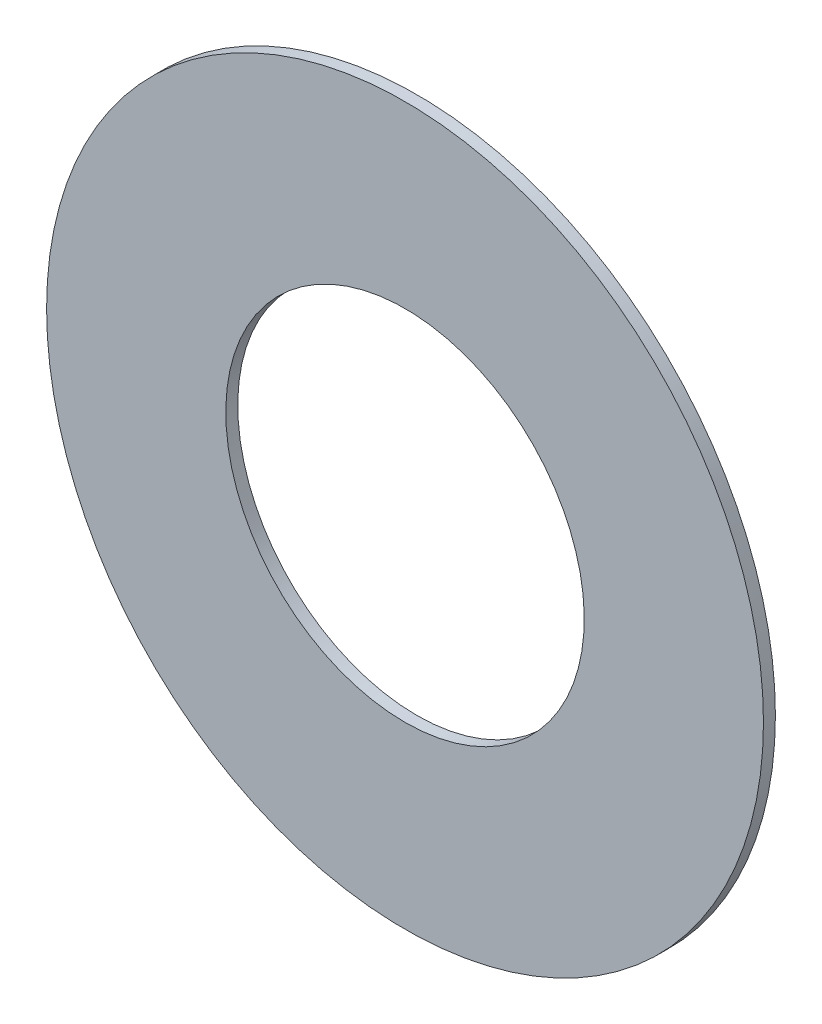
ISO-10303-21;
HEADER;
FILE_DESCRIPTION(('STEP AP214'),'2;1');
FILE_NAME('part.step','',(''),(''),'','','');
FILE_SCHEMA(('AUTOMOTIVE_DESIGN { 1 0 10303 214 1 1 1 1 }'));
ENDSEC;
DATA;
#1=APPLICATION_CONTEXT('core data for automotive mechanical design processes');
#2=APPLICATION_PROTOCOL_DEFINITION('international standard','automotive_design',2000,#1);
#3=PRODUCT_CONTEXT('',#1,'mechanical');
#4=PRODUCT('Part','Part','',(#3));
#5=PRODUCT_RELATED_PRODUCT_CATEGORY('part','',(#4));
#6=PRODUCT_DEFINITION_FORMATION('','',#4);
#7=PRODUCT_DEFINITION_CONTEXT('part definition',#1,'design');
#8=PRODUCT_DEFINITION('design','',#6,#7);
#9=PRODUCT_DEFINITION_SHAPE('','',#8);
#10=(LENGTH_UNIT() NAMED_UNIT(*) SI_UNIT(.MILLI.,.METRE.));
#11=(NAMED_UNIT(*) PLANE_ANGLE_UNIT() SI_UNIT($,.RADIAN.));
#12=(NAMED_UNIT(*) SI_UNIT($,.STERADIAN.) SOLID_ANGLE_UNIT());
#13=UNCERTAINTY_MEASURE_WITH_UNIT(LENGTH_MEASURE(1.E-05),#10,'distance_accuracy_value','');
#14=(GEOMETRIC_REPRESENTATION_CONTEXT(3) GLOBAL_UNCERTAINTY_ASSIGNED_CONTEXT((#13)) GLOBAL_UNIT_ASSIGNED_CONTEXT((#10,
#11,#12)) REPRESENTATION_CONTEXT('',''));
#15=CARTESIAN_POINT('',(0.,0.,0.));
#16=DIRECTION('',(0.,0.,1.));
#17=DIRECTION('',(1.,0.,0.));
#18=AXIS2_PLACEMENT_3D('',#15,#16,#17);
#19=CARTESIAN_POINT('',(139.452,-114.284,-0.045));
#20=DIRECTION('',(0.,0.,-1.));
#21=DIRECTION('',(0.,-1.,0.));
#22=AXIS2_PLACEMENT_3D('',#19,#20,#21);
#23=CYLINDRICAL_SURFACE('',#22,0.525);
#24=CARTESIAN_POINT('',(139.452,-114.284,-0.035));
#25=DIRECTION('',(0.,0.,-1.));
#26=DIRECTION('',(0.,-1.,0.));
#27=AXIS2_PLACEMENT_3D('',#24,#25,#26);
#28=CIRCLE('',#27,0.525);
#29=CARTESIAN_POINT('',(139.452,-114.809,-0.035));
#30=VERTEX_POINT('',#29);
#31=EDGE_CURVE('E25',#30,#30,#28,.T.);
#32=ORIENTED_EDGE('',*,*,#31,.T.);
#33=DIRECTION('',(0.,0.,1.));
#34=VECTOR('',#33,1.);
#35=CARTESIAN_POINT('',(139.452,-114.809,-0.045));
#36=LINE('',#35,#34);
#37=CARTESIAN_POINT('',(139.452,-114.809,0.));
#38=VERTEX_POINT('',#37);
#39=EDGE_CURVE('E11',#30,#38,#36,.T.);
#40=ORIENTED_EDGE('',*,*,#39,.T.);
#41=CARTESIAN_POINT('',(139.452,-114.284,0.));
#42=DIRECTION('',(0.,0.,-1.));
#43=DIRECTION('',(0.,-1.,0.));
#44=AXIS2_PLACEMENT_3D('',#41,#42,#43);
#45=CIRCLE('',#44,0.525);
#46=EDGE_CURVE('E67',#38,#38,#45,.T.);
#47=ORIENTED_EDGE('',*,*,#46,.F.);
#48=ORIENTED_EDGE('',*,*,#39,.F.);
#49=EDGE_LOOP('',(#32,#40,#47,#48));
#50=FACE_BOUND('',#49,.T.);
#51=ADVANCED_FACE('F17',(#50),#23,.F.);
#52=CARTESIAN_POINT('',(139.452,-114.284,-0.035));
#53=DIRECTION('',(0.,0.,1.));
#54=DIRECTION('',(1.,0.,0.));
#55=AXIS2_PLACEMENT_3D('',#52,#53,#54);
#56=PLANE('',#55);
#57=ORIENTED_EDGE('',*,*,#31,.F.);
#58=EDGE_LOOP('',(#57));
#59=FACE_BOUND('',#58,.T.);
#60=CARTESIAN_POINT('',(139.452,-114.284,-0.035));
#61=DIRECTION('',(0.,0.,1.));
#62=DIRECTION('',(1.,0.,0.));
#63=AXIS2_PLACEMENT_3D('',#60,#61,#62);
#64=CIRCLE('',#63,1.05);
#65=CARTESIAN_POINT('',(140.502,-114.284,-0.035));
#66=VERTEX_POINT('',#65);
#67=EDGE_CURVE('E56',#66,#66,#64,.T.);
#68=ORIENTED_EDGE('',*,*,#67,.F.);
#69=EDGE_LOOP('',(#68));
#70=FACE_BOUND('',#69,.T.);
#71=ADVANCED_FACE('F76',(#59,#70),#56,.F.);
#72=CARTESIAN_POINT('',(139.452,-114.284,0.));
#73=DIRECTION('',(0.,0.,1.));
#74=DIRECTION('',(1.,0.,0.));
#75=AXIS2_PLACEMENT_3D('',#72,#73,#74);
#76=PLANE('',#75);
#77=ORIENTED_EDGE('',*,*,#46,.T.);
#78=EDGE_LOOP('',(#77));
#79=FACE_BOUND('',#78,.T.);
#80=CARTESIAN_POINT('',(139.452,-114.284,0.));
#81=DIRECTION('',(0.,0.,1.));
#82=DIRECTION('',(1.,0.,0.));
#83=AXIS2_PLACEMENT_3D('',#80,#81,#82);
#84=CIRCLE('',#83,1.05);
#85=CARTESIAN_POINT('',(140.502,-114.284,0.));
#86=VERTEX_POINT('',#85);
#87=EDGE_CURVE('E54',#86,#86,#84,.T.);
#88=ORIENTED_EDGE('',*,*,#87,.T.);
#89=EDGE_LOOP('',(#88));
#90=FACE_BOUND('',#89,.T.);
#91=ADVANCED_FACE('F60',(#79,#90),#76,.T.);
#92=CARTESIAN_POINT('',(139.452,-114.284,-0.035));
#93=DIRECTION('',(0.,0.,1.));
#94=DIRECTION('',(1.,0.,0.));
#95=AXIS2_PLACEMENT_3D('',#92,#93,#94);
#96=CYLINDRICAL_SURFACE('',#95,1.05);
#97=ORIENTED_EDGE('',*,*,#87,.F.);
#98=DIRECTION('',(0.,0.,1.));
#99=VECTOR('',#98,1.);
#100=CARTESIAN_POINT('',(140.502,-114.284,-0.035));
#101=LINE('',#100,#99);
#102=EDGE_CURVE('E51',#66,#86,#101,.T.);
#103=ORIENTED_EDGE('',*,*,#102,.F.);
#104=ORIENTED_EDGE('',*,*,#67,.T.);
#105=ORIENTED_EDGE('',*,*,#102,.T.);
#106=EDGE_LOOP('',(#97,#103,#104,#105));
#107=FACE_BOUND('',#106,.T.);
#108=ADVANCED_FACE('F53',(#107),#96,.T.);
#109=CLOSED_SHELL('',(#51,#71,#91,#108));
#110=MANIFOLD_SOLID_BREP('B1',#109);
#111=ADVANCED_BREP_SHAPE_REPRESENTATION('',(#18,#110),#14);
#112=SHAPE_DEFINITION_REPRESENTATION(#9,#111);
ENDSEC;
END-ISO-10303-21;
